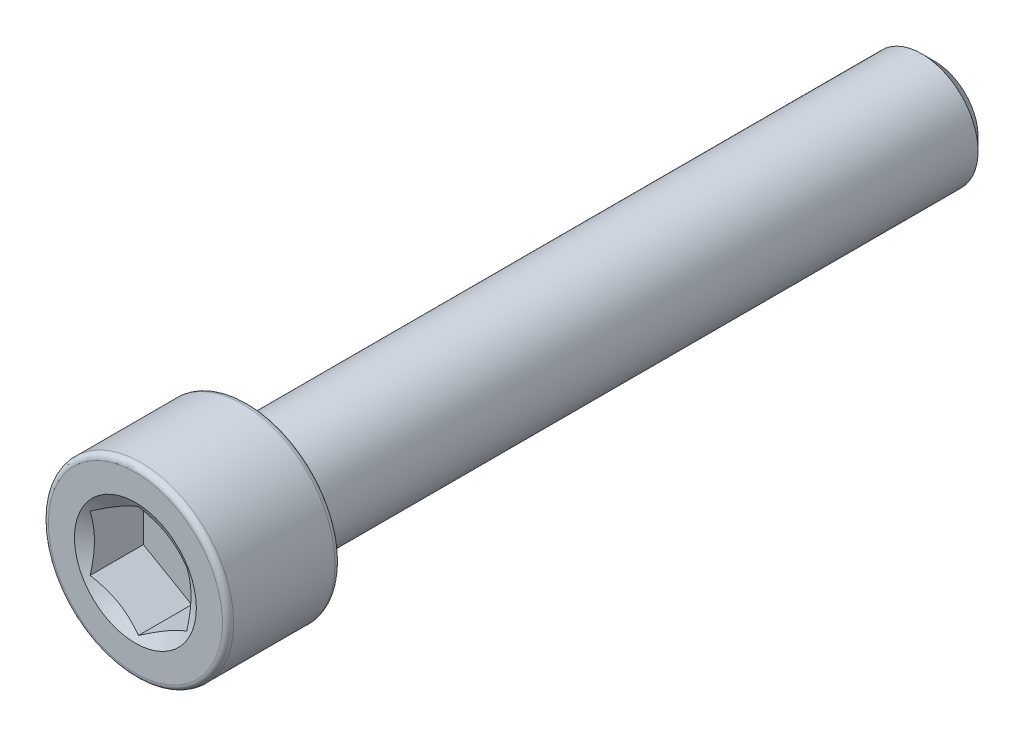
ISO-10303-21;
HEADER;
FILE_DESCRIPTION(('STEP AP214'),'2;1');
FILE_NAME('part.step','',(''),(''),'','','');
FILE_SCHEMA(('AUTOMOTIVE_DESIGN { 1 0 10303 214 1 1 1 1 }'));
ENDSEC;
DATA;
#1=APPLICATION_CONTEXT('core data for automotive mechanical design processes');
#2=APPLICATION_PROTOCOL_DEFINITION('international standard','automotive_design',2000,#1);
#3=PRODUCT_CONTEXT('',#1,'mechanical');
#4=PRODUCT('Part','Part','',(#3));
#5=PRODUCT_RELATED_PRODUCT_CATEGORY('part','',(#4));
#6=PRODUCT_DEFINITION_FORMATION('','',#4);
#7=PRODUCT_DEFINITION_CONTEXT('part definition',#1,'design');
#8=PRODUCT_DEFINITION('design','',#6,#7);
#9=PRODUCT_DEFINITION_SHAPE('','',#8);
#10=(LENGTH_UNIT() NAMED_UNIT(*) SI_UNIT(.MILLI.,.METRE.));
#11=(NAMED_UNIT(*) PLANE_ANGLE_UNIT() SI_UNIT($,.RADIAN.));
#12=(NAMED_UNIT(*) SI_UNIT($,.STERADIAN.) SOLID_ANGLE_UNIT());
#13=UNCERTAINTY_MEASURE_WITH_UNIT(LENGTH_MEASURE(1.E-05),#10,'distance_accuracy_value','');
#14=(GEOMETRIC_REPRESENTATION_CONTEXT(3) GLOBAL_UNCERTAINTY_ASSIGNED_CONTEXT((#13)) GLOBAL_UNIT_ASSIGNED_CONTEXT((#10,
#11,#12)) REPRESENTATION_CONTEXT('',''));
#15=CARTESIAN_POINT('',(0.,0.,0.));
#16=DIRECTION('',(0.,0.,1.));
#17=DIRECTION('',(1.,0.,0.));
#18=AXIS2_PLACEMENT_3D('',#15,#16,#17);
#19=CARTESIAN_POINT('',(0.,0.,-14.7828));
#20=DIRECTION('',(0.,0.,-1.));
#21=DIRECTION('',(-1.,0.,0.));
#22=AXIS2_PLACEMENT_3D('',#19,#20,#21);
#23=PLANE('',#22);
#24=CARTESIAN_POINT('',(0.,0.,-14.7828));
#25=DIRECTION('',(0.,0.,-1.));
#26=DIRECTION('',(-1.,0.,0.));
#27=AXIS2_PLACEMENT_3D('',#24,#25,#26);
#28=CIRCLE('',#27,1.60655000000001);
#29=CARTESIAN_POINT('',(-1.60655000000001,0.,-14.7828));
#30=VERTEX_POINT('',#29);
#31=EDGE_CURVE('E57',#30,#30,#28,.T.);
#32=ORIENTED_EDGE('',*,*,#31,.T.);
#33=EDGE_LOOP('',(#32));
#34=FACE_BOUND('',#33,.T.);
#35=ADVANCED_FACE('F43',(#34),#23,.T.);
#36=CARTESIAN_POINT('',(0.,0.,-14.7828));
#37=DIRECTION('',(0.,0.,1.));
#38=DIRECTION('',(1.,0.,0.));
#39=AXIS2_PLACEMENT_3D('',#36,#37,#38);
#40=CONICAL_SURFACE('',#39,1.60655000000001,0.78539816339745);
#41=CARTESIAN_POINT('',(0.,0.,-14.30655));
#42=DIRECTION('',(0.,0.,-1.));
#43=DIRECTION('',(-1.,0.,0.));
#44=AXIS2_PLACEMENT_3D('',#41,#42,#43);
#45=CIRCLE('',#44,2.08280000000001);
#46=CARTESIAN_POINT('',(-2.08280000000001,0.,-14.30655));
#47=VERTEX_POINT('',#46);
#48=EDGE_CURVE('E151',#47,#47,#45,.T.);
#49=ORIENTED_EDGE('',*,*,#48,.T.);
#50=EDGE_LOOP('',(#49));
#51=FACE_BOUND('',#50,.T.);
#52=ORIENTED_EDGE('',*,*,#31,.F.);
#53=EDGE_LOOP('',(#52));
#54=FACE_BOUND('',#53,.T.);
#55=ADVANCED_FACE('F159',(#51,#54),#40,.T.);
#56=CARTESIAN_POINT('',(0.,0.,-14.7828));
#57=DIRECTION('',(0.,0.,-1.));
#58=DIRECTION('',(-1.,0.,0.));
#59=AXIS2_PLACEMENT_3D('',#56,#57,#58);
#60=CYLINDRICAL_SURFACE('',#59,2.08280000000001);
#61=CARTESIAN_POINT('',(0.,0.,10.6172));
#62=DIRECTION('',(0.,0.,-1.));
#63=DIRECTION('',(-1.,0.,0.));
#64=AXIS2_PLACEMENT_3D('',#61,#62,#63);
#65=CIRCLE('',#64,2.08280000000001);
#66=CARTESIAN_POINT('',(-2.08280000000001,0.,10.6172));
#67=VERTEX_POINT('',#66);
#68=EDGE_CURVE('E147',#67,#67,#65,.T.);
#69=ORIENTED_EDGE('',*,*,#68,.T.);
#70=EDGE_LOOP('',(#69));
#71=FACE_BOUND('',#70,.T.);
#72=ORIENTED_EDGE('',*,*,#48,.F.);
#73=EDGE_LOOP('',(#72));
#74=FACE_BOUND('',#73,.T.);
#75=ADVANCED_FACE('F161',(#71,#74),#60,.T.);
#76=CARTESIAN_POINT('',(0.,2.0828,10.6172));
#77=DIRECTION('',(0.,0.,-1.));
#78=DIRECTION('',(-1.,0.,0.));
#79=AXIS2_PLACEMENT_3D('',#76,#77,#78);
#80=PLANE('',#79);
#81=CARTESIAN_POINT('',(0.,0.,10.6172));
#82=DIRECTION('',(0.,0.,-1.));
#83=DIRECTION('',(-1.,0.,0.));
#84=AXIS2_PLACEMENT_3D('',#81,#82,#83);
#85=CIRCLE('',#84,3.22072);
#86=CARTESIAN_POINT('',(-3.22072,0.,10.6172));
#87=VERTEX_POINT('',#86);
#88=EDGE_CURVE('E143',#87,#87,#85,.T.);
#89=ORIENTED_EDGE('',*,*,#88,.T.);
#90=EDGE_LOOP('',(#89));
#91=FACE_BOUND('',#90,.T.);
#92=ORIENTED_EDGE('',*,*,#68,.F.);
#93=EDGE_LOOP('',(#92));
#94=FACE_BOUND('',#93,.T.);
#95=ADVANCED_FACE('F168',(#91,#94),#80,.T.);
#96=CARTESIAN_POINT('',(0.,0.,10.82548));
#97=DIRECTION('',(0.,0.,-1.));
#98=DIRECTION('',(-1.,0.,0.));
#99=AXIS2_PLACEMENT_3D('',#96,#97,#98);
#100=TOROIDAL_SURFACE('',#99,3.22072,0.20828);
#101=CARTESIAN_POINT('',(0.,0.,10.82548));
#102=DIRECTION('',(0.,0.,-1.));
#103=DIRECTION('',(-1.,0.,0.));
#104=AXIS2_PLACEMENT_3D('',#101,#102,#103);
#105=CIRCLE('',#104,3.429);
#106=CARTESIAN_POINT('',(-3.429,0.,10.82548));
#107=VERTEX_POINT('',#106);
#108=EDGE_CURVE('E139',#107,#107,#105,.T.);
#109=ORIENTED_EDGE('',*,*,#108,.T.);
#110=EDGE_LOOP('',(#109));
#111=FACE_BOUND('',#110,.T.);
#112=ORIENTED_EDGE('',*,*,#88,.F.);
#113=EDGE_LOOP('',(#112));
#114=FACE_BOUND('',#113,.T.);
#115=ADVANCED_FACE('F174',(#111,#114),#100,.T.);
#116=CARTESIAN_POINT('',(0.,0.,-14.7828));
#117=DIRECTION('',(0.,0.,-1.));
#118=DIRECTION('',(-1.,0.,0.));
#119=AXIS2_PLACEMENT_3D('',#116,#117,#118);
#120=CYLINDRICAL_SURFACE('',#119,3.429);
#121=CARTESIAN_POINT('',(0.,0.,14.57452));
#122=DIRECTION('',(0.,0.,-1.));
#123=DIRECTION('',(-1.,0.,0.));
#124=AXIS2_PLACEMENT_3D('',#121,#122,#123);
#125=CIRCLE('',#124,3.429);
#126=CARTESIAN_POINT('',(-3.429,0.,14.57452));
#127=VERTEX_POINT('',#126);
#128=EDGE_CURVE('E135',#127,#127,#125,.T.);
#129=ORIENTED_EDGE('',*,*,#128,.T.);
#130=EDGE_LOOP('',(#129));
#131=FACE_BOUND('',#130,.T.);
#132=ORIENTED_EDGE('',*,*,#108,.F.);
#133=EDGE_LOOP('',(#132));
#134=FACE_BOUND('',#133,.T.);
#135=ADVANCED_FACE('F178',(#131,#134),#120,.T.);
#136=CARTESIAN_POINT('',(0.,0.,14.57452));
#137=DIRECTION('',(0.,0.,-1.));
#138=DIRECTION('',(-1.,0.,0.));
#139=AXIS2_PLACEMENT_3D('',#136,#137,#138);
#140=TOROIDAL_SURFACE('',#139,3.22072,0.208279999999999);
#141=CARTESIAN_POINT('',(0.,0.,14.7828));
#142=DIRECTION('',(0.,0.,-1.));
#143=DIRECTION('',(-1.,0.,0.));
#144=AXIS2_PLACEMENT_3D('',#141,#142,#143);
#145=CIRCLE('',#144,3.22072);
#146=CARTESIAN_POINT('',(-3.22072,0.,14.7828));
#147=VERTEX_POINT('',#146);
#148=EDGE_CURVE('E131',#147,#147,#145,.T.);
#149=ORIENTED_EDGE('',*,*,#148,.T.);
#150=EDGE_LOOP('',(#149));
#151=FACE_BOUND('',#150,.T.);
#152=ORIENTED_EDGE('',*,*,#128,.F.);
#153=EDGE_LOOP('',(#152));
#154=FACE_BOUND('',#153,.T.);
#155=ADVANCED_FACE('F182',(#151,#154),#140,.T.);
#156=CARTESIAN_POINT('',(0.,3.22072,14.7828));
#157=DIRECTION('',(0.,0.,1.));
#158=DIRECTION('',(1.,0.,0.));
#159=AXIS2_PLACEMENT_3D('',#156,#157,#158);
#160=PLANE('',#159);
#161=CARTESIAN_POINT('',(0.,0.,14.7828));
#162=DIRECTION('',(0.,0.,1.));
#163=DIRECTION('',(1.,0.,0.));
#164=AXIS2_PLACEMENT_3D('',#161,#162,#163);
#165=CIRCLE('',#164,2.25530582730141);
#166=CARTESIAN_POINT('',(2.25530582730141,0.,14.7828));
#167=VERTEX_POINT('',#166);
#168=EDGE_CURVE('E290',#167,#167,#165,.T.);
#169=ORIENTED_EDGE('',*,*,#168,.F.);
#170=EDGE_LOOP('',(#169));
#171=FACE_BOUND('',#170,.T.);
#172=ORIENTED_EDGE('',*,*,#148,.F.);
#173=EDGE_LOOP('',(#172));
#174=FACE_BOUND('',#173,.T.);
#175=ADVANCED_FACE('F186',(#171,#174),#160,.T.);
#176=CARTESIAN_POINT('',(0.,0.,14.7828));
#177=DIRECTION('',(0.,0.,1.));
#178=DIRECTION('',(1.,0.,0.));
#179=AXIS2_PLACEMENT_3D('',#176,#177,#178);
#180=CONICAL_SURFACE('',#179,2.25530582730141,1.0471975511966);
#181=ORIENTED_EDGE('',*,*,#168,.T.);
#182=EDGE_LOOP('',(#181));
#183=FACE_BOUND('',#182,.T.);
#184=CARTESIAN_POINT('',(1.7861375,1.03099602632701,14.6713902457683));
#185=CARTESIAN_POINT('',(1.70765298753214,1.07630908072754,14.6452168076921));
#186=CARTESIAN_POINT('',(1.62849100532972,1.12201327246169,14.6214125992998));
#187=CARTESIAN_POINT('',(1.46879612904912,1.2142131522705,14.5798611490479));
#188=CARTESIAN_POINT('',(1.38826039638754,1.26071047920205,14.5621286082323));
#189=CARTESIAN_POINT('',(1.22818707140352,1.35312885647165,14.5345240038494));
#190=CARTESIAN_POINT('',(1.14867411525882,1.39903568310585,14.524468239448));
#191=CARTESIAN_POINT('',(0.989273866724133,1.49106545950625,14.5124614604738));
#192=CARTESIAN_POINT('',(0.90938715411785,1.53718807453416,14.5105005056729));
#193=CARTESIAN_POINT('',(0.76010104079842,1.62337845224541,14.5145693606205));
#194=CARTESIAN_POINT('',(0.69067934773042,1.66345908542582,14.5196001252606));
#195=CARTESIAN_POINT('',(0.552288266102525,1.74335921365712,14.5355479939992));
#196=CARTESIAN_POINT('',(0.483319356586403,1.78317843213197,14.5464705514371));
#197=CARTESIAN_POINT('',(0.34464269577066,1.86324343958426,14.5737773973743));
#198=CARTESIAN_POINT('',(0.274952505639711,1.90347908961624,14.5902774949854));
#199=CARTESIAN_POINT('',(0.13661183024592,1.98335011579472,14.6277267258336));
#200=CARTESIAN_POINT('',(0.0679595711845167,2.0229865160443,14.6486670537832));
#201=CARTESIAN_POINT('',(-0.000200000000001202,2.06233846281553,14.6713902457683));
#202=B_SPLINE_CURVE_WITH_KNOTS('',3,(#184,#185,#186,#187,#188,#189,#190,#191,#192,#193,#194,
#195,#196,#197,#198,#199,#200,#201),.UNSPECIFIED.,.F.,.F.,(4,2,2,2,2,2,2,2,4),(0.,
0.283101204842065,0.566883100888333,0.84364073208294,1.12005841039329,1.3607861247116,
1.60173703564045,1.84803423693754,2.09384750668611),.UNSPECIFIED.);
#203=CARTESIAN_POINT('',(1.7859375,1.03111149638084,14.6713235735026));
#204=VERTEX_POINT('',#203);
#205=CARTESIAN_POINT('',(0.,2.06222299276169,14.6713235735026));
#206=VERTEX_POINT('',#205);
#207=EDGE_CURVE('E112',#204,#206,#202,.T.);
#208=ORIENTED_EDGE('',*,*,#207,.F.);
#209=CARTESIAN_POINT('',(1.7859375,-2.69758264771829,15.3485426868391));
#210=CARTESIAN_POINT('',(1.7859375,-2.6201225904152,15.3112636843077));
#211=CARTESIAN_POINT('',(1.7859375,-2.5424766848385,15.2743637946794));
#212=CARTESIAN_POINT('',(1.7859375,-2.38671397459031,15.2015371845213));
#213=CARTESIAN_POINT('',(1.7859375,-2.30859709065796,15.1656106337188));
#214=CARTESIAN_POINT('',(1.7859375,-2.15135521009003,15.0947492558914));
#215=CARTESIAN_POINT('',(1.7859375,-2.0722269823703,15.0598215722438));
#216=CARTESIAN_POINT('',(1.7859375,-1.91331493598689,14.9914965769099));
#217=CARTESIAN_POINT('',(1.7859375,-1.83353115094795,14.9580991873029));
#218=CARTESIAN_POINT('',(1.7859375,-1.67096618357135,14.8923456687277));
#219=CARTESIAN_POINT('',(1.7859375,-1.58816300038914,14.8600436191632));
#220=CARTESIAN_POINT('',(1.7859375,-1.42156112656087,14.7980632721621));
#221=CARTESIAN_POINT('',(1.7859375,-1.33776231333349,14.7683853016785));
#222=CARTESIAN_POINT('',(1.7859375,-1.1692220220391,14.7124867539738));
#223=CARTESIAN_POINT('',(1.7859375,-1.084483165363,14.6862583568392));
#224=CARTESIAN_POINT('',(1.7859375,-0.913786163547338,14.6381433270575));
#225=CARTESIAN_POINT('',(1.7859375,-0.827828324781464,14.6162556234588));
#226=CARTESIAN_POINT('',(1.7859375,-0.65508454988443,14.5780261588678));
#227=CARTESIAN_POINT('',(1.7859375,-0.568304335338395,14.5616590421217));
#228=CARTESIAN_POINT('',(1.7859375,-0.393746048068967,14.5354528135952));
#229=CARTESIAN_POINT('',(1.7859375,-0.305968052538009,14.5256132002697));
#230=CARTESIAN_POINT('',(1.7859375,-0.130962716485577,14.5133785557359));
#231=CARTESIAN_POINT('',(1.7859375,-0.0437418469765716,14.5108936055758));
#232=CARTESIAN_POINT('',(1.7859375,0.130592934900125,14.513336070232));
#233=CARTESIAN_POINT('',(1.7859375,0.21770684100056,14.518263900411));
#234=CARTESIAN_POINT('',(1.7859375,0.431120733446831,14.5389821974728));
#235=CARTESIAN_POINT('',(1.7859375,0.557038517233457,14.5587228004352));
#236=CARTESIAN_POINT('',(1.7859375,0.806440222774732,14.6100381632509));
#237=CARTESIAN_POINT('',(1.7859375,0.929921492877505,14.6416251403236));
#238=CARTESIAN_POINT('',(1.7859375,1.17712757795221,14.7140666470735));
#239=CARTESIAN_POINT('',(1.7859375,1.30079401125151,14.7551156843391));
#240=CARTESIAN_POINT('',(1.7859375,1.48458504652945,14.8212570287602));
#241=CARTESIAN_POINT('',(1.7859375,1.54555601200979,14.8440621265715));
#242=CARTESIAN_POINT('',(1.7859375,1.66700448583618,14.8909509496154));
#243=CARTESIAN_POINT('',(1.7859375,1.72748200297302,14.9150346520121));
#244=CARTESIAN_POINT('',(1.7859375,1.88424149051046,14.9790616553898));
#245=CARTESIAN_POINT('',(1.7859375,1.98018443802618,15.0198329191166));
#246=CARTESIAN_POINT('',(1.7859375,2.17117609670512,15.1034247196407));
#247=CARTESIAN_POINT('',(1.7859375,2.26622473668082,15.1462454179505));
#248=CARTESIAN_POINT('',(1.7859375,2.55034675834729,15.2770525004115));
#249=CARTESIAN_POINT('',(1.7859375,2.73834755541705,15.3673633596409));
#250=CARTESIAN_POINT('',(1.7859375,3.11271398702262,15.5518619991649));
#251=CARTESIAN_POINT('',(1.7859375,3.29907721105926,15.6460546102587));
#252=CARTESIAN_POINT('',(1.7859375,3.67050227471046,15.8368957072539));
#253=CARTESIAN_POINT('',(1.7859375,3.85556431392614,15.9335438055063));
#254=CARTESIAN_POINT('',(1.7859375,4.20682233829504,16.11903234663));
#255=CARTESIAN_POINT('',(1.7859375,4.37310096820637,16.207716846137));
#256=CARTESIAN_POINT('',(1.7859375,4.70512305489091,16.3860996279772));
#257=CARTESIAN_POINT('',(1.7859375,4.87086648642208,16.4757979572539));
#258=CARTESIAN_POINT('',(1.7859375,5.20149434658741,16.6557084214208));
#259=CARTESIAN_POINT('',(1.7859375,5.36637988633188,16.7459185171521));
#260=CARTESIAN_POINT('',(1.7859375,5.69581647813698,16.9269235664943));
#261=CARTESIAN_POINT('',(1.7859375,5.86036755026335,17.0177184835707));
#262=CARTESIAN_POINT('',(1.7859375,6.02479942172329,17.1087274610164));
#263=B_SPLINE_CURVE_WITH_KNOTS('',3,(#209,#210,#211,#212,#213,#214,#215,#216,#217,#218,#219,
#220,#221,#222,#223,#224,#225,#226,#227,#228,#229,#230,#231,#232,#233,#234,#235,#236,#237,#238,
#239,#240,#241,#242,#243,#244,#245,#246,#247,#248,#249,#250,#251,#252,#253,#254,#255,#256,#257,
#258,#259,#260,#261,#262),.UNSPECIFIED.,.F.,.F.,(4,2,2,2,2,2,2,2,2,2,2,2,2,2,2,2,2,2,2,2,2,2,2,
2,2,2,4),(0.,0.257895100869512,0.515834886822403,0.775304092310056,1.03476007121658,
1.30136802092372,1.56800914256978,1.83403498977159,2.09999512023697,2.36471652541159,
2.62941758818124,2.89086873629834,3.15233453493419,3.53391158235073,3.91588323889408,
4.30654567753013,4.50182529543226,4.69710142679918,5.00980707595598,5.3225374096282,
5.94815647890532,6.57457913899203,7.20090351250652,7.76625052018439,8.33162381337451,
8.89547174137729,9.45928478023968),.UNSPECIFIED.);
#264=CARTESIAN_POINT('',(1.7859375,-1.03111149638084,14.6713235735026));
#265=VERTEX_POINT('',#264);
#266=EDGE_CURVE('E232',#265,#204,#263,.T.);
#267=ORIENTED_EDGE('',*,*,#266,.F.);
#268=CARTESIAN_POINT('',(-0.000200000000001353,-2.06233846281553,14.6713902457683));
#269=CARTESIAN_POINT('',(0.078284512467857,-2.01702540841499,14.6452168076921));
#270=CARTESIAN_POINT('',(0.157446494670274,-1.97132121668084,14.6214125992998));
#271=CARTESIAN_POINT('',(0.317141370950877,-1.87912133687203,14.5798611490479));
#272=CARTESIAN_POINT('',(0.397677103612454,-1.83262400994049,14.5621286082323));
#273=CARTESIAN_POINT('',(0.557750428596472,-1.74020563267089,14.5345240038494));
#274=CARTESIAN_POINT('',(0.63726338474117,-1.69429880603668,14.524468239448));
#275=CARTESIAN_POINT('',(0.796663633275862,-1.60226902963629,14.5124614604738));
#276=CARTESIAN_POINT('',(0.876550345882144,-1.55614641460837,14.5105005056729));
#277=CARTESIAN_POINT('',(1.02583645920157,-1.46995603689713,14.5145693606205));
#278=CARTESIAN_POINT('',(1.09525815226957,-1.42987540371672,14.5196001252606));
#279=CARTESIAN_POINT('',(1.23364923389747,-1.34997527548541,14.5355479939992));
#280=CARTESIAN_POINT('',(1.30261814341359,-1.31015605701056,14.5464705514371));
#281=CARTESIAN_POINT('',(1.44129480422933,-1.23009104955827,14.5737773973743));
#282=CARTESIAN_POINT('',(1.51098499436028,-1.1898553995263,14.5902774949854));
#283=CARTESIAN_POINT('',(1.64932566975407,-1.10998437334781,14.6277267258336));
#284=CARTESIAN_POINT('',(1.71797792881548,-1.07034797309824,14.6486670537832));
#285=CARTESIAN_POINT('',(1.7861375,-1.03099602632701,14.6713902457683));
#286=B_SPLINE_CURVE_WITH_KNOTS('',3,(#268,#269,#270,#271,#272,#273,#274,#275,#276,#277,#278,
#279,#280,#281,#282,#283,#284,#285),.UNSPECIFIED.,.F.,.F.,(4,2,2,2,2,2,2,2,4),(0.,
0.283101204842065,0.566883100888333,0.84364073208294,1.12005841039329,1.3607861247116,
1.60173703564045,1.84803423693754,2.09384750668611),.UNSPECIFIED.);
#287=CARTESIAN_POINT('',(0.,-2.06222299276169,14.6713235735026));
#288=VERTEX_POINT('',#287);
#289=EDGE_CURVE('E226',#288,#265,#286,.T.);
#290=ORIENTED_EDGE('',*,*,#289,.F.);
#291=CARTESIAN_POINT('',(-1.7861375,-1.03099602632701,14.6713902457683));
#292=CARTESIAN_POINT('',(-1.70765298753214,-1.07630908072754,14.6452168076921));
#293=CARTESIAN_POINT('',(-1.62849100532972,-1.12201327246169,14.6214125992998));
#294=CARTESIAN_POINT('',(-1.46879612904912,-1.2142131522705,14.5798611490479));
#295=CARTESIAN_POINT('',(-1.38826039638754,-1.26071047920205,14.5621286082323));
#296=CARTESIAN_POINT('',(-1.22818707140352,-1.35312885647165,14.5345240038494));
#297=CARTESIAN_POINT('',(-1.14867411525882,-1.39903568310585,14.524468239448));
#298=CARTESIAN_POINT('',(-0.989273866724133,-1.49106545950625,14.5124614604738));
#299=CARTESIAN_POINT('',(-0.90938715411785,-1.53718807453416,14.5105005056729));
#300=CARTESIAN_POINT('',(-0.760101040798421,-1.62337845224541,14.5145693606205));
#301=CARTESIAN_POINT('',(-0.69067934773042,-1.66345908542582,14.5196001252606));
#302=CARTESIAN_POINT('',(-0.552288266102526,-1.74335921365713,14.5355479939992));
#303=CARTESIAN_POINT('',(-0.483319356586404,-1.78317843213197,14.5464705514371));
#304=CARTESIAN_POINT('',(-0.344642695770662,-1.86324343958426,14.5737773973743));
#305=CARTESIAN_POINT('',(-0.274952505639713,-1.90347908961624,14.5902774949854));
#306=CARTESIAN_POINT('',(-0.136611830245922,-1.98335011579472,14.6277267258336));
#307=CARTESIAN_POINT('',(-0.0679595711845196,-2.0229865160443,14.6486670537832));
#308=CARTESIAN_POINT('',(0.000199999999998539,-2.06233846281553,14.6713902457683));
#309=B_SPLINE_CURVE_WITH_KNOTS('',3,(#291,#292,#293,#294,#295,#296,#297,#298,#299,#300,#301,
#302,#303,#304,#305,#306,#307,#308),.UNSPECIFIED.,.F.,.F.,(4,2,2,2,2,2,2,2,4),(0.,
0.283101204842066,0.566883100888334,0.84364073208294,1.12005841039329,1.3607861247116,
1.60173703564045,1.84803423693754,2.0938475066861),.UNSPECIFIED.);
#310=CARTESIAN_POINT('',(-1.7859375,-1.03111149638085,14.6713235735026));
#311=VERTEX_POINT('',#310);
#312=EDGE_CURVE('E64',#311,#288,#309,.T.);
#313=ORIENTED_EDGE('',*,*,#312,.F.);
#314=CARTESIAN_POINT('',(-1.7859375,-2.6975826477183,15.3485426868391));
#315=CARTESIAN_POINT('',(-1.7859375,-2.6201225904152,15.3112636843077));
#316=CARTESIAN_POINT('',(-1.7859375,-2.5424766848385,15.2743637946794));
#317=CARTESIAN_POINT('',(-1.7859375,-2.38671397459032,15.2015371845213));
#318=CARTESIAN_POINT('',(-1.7859375,-2.30859709065796,15.1656106337188));
#319=CARTESIAN_POINT('',(-1.7859375,-2.15135521009004,15.0947492558914));
#320=CARTESIAN_POINT('',(-1.7859375,-2.0722269823703,15.0598215722438));
#321=CARTESIAN_POINT('',(-1.7859375,-1.9133149359869,14.9914965769099));
#322=CARTESIAN_POINT('',(-1.7859375,-1.83353115094795,14.9580991873029));
#323=CARTESIAN_POINT('',(-1.7859375,-1.67096618357136,14.8923456687277));
#324=CARTESIAN_POINT('',(-1.7859375,-1.58816300038914,14.8600436191632));
#325=CARTESIAN_POINT('',(-1.7859375,-1.42156112656088,14.7980632721621));
#326=CARTESIAN_POINT('',(-1.7859375,-1.33776231333349,14.7683853016785));
#327=CARTESIAN_POINT('',(-1.7859375,-1.16922202203911,14.7124867539738));
#328=CARTESIAN_POINT('',(-1.7859375,-1.084483165363,14.6862583568392));
#329=CARTESIAN_POINT('',(-1.7859375,-0.913786163547341,14.6381433270575));
#330=CARTESIAN_POINT('',(-1.7859375,-0.827828324781467,14.6162556234588));
#331=CARTESIAN_POINT('',(-1.7859375,-0.655084549884432,14.5780261588678));
#332=CARTESIAN_POINT('',(-1.7859375,-0.568304335338397,14.5616590421217));
#333=CARTESIAN_POINT('',(-1.7859375,-0.393746048068968,14.5354528135952));
#334=CARTESIAN_POINT('',(-1.7859375,-0.30596805253801,14.5256132002697));
#335=CARTESIAN_POINT('',(-1.7859375,-0.130962716485578,14.5133785557359));
#336=CARTESIAN_POINT('',(-1.7859375,-0.0437418469765717,14.5108936055758));
#337=CARTESIAN_POINT('',(-1.7859375,0.130592934900126,14.513336070232));
#338=CARTESIAN_POINT('',(-1.7859375,0.217706841000561,14.518263900411));
#339=CARTESIAN_POINT('',(-1.7859375,0.431120733446832,14.5389821974728));
#340=CARTESIAN_POINT('',(-1.7859375,0.557038517233458,14.5587228004352));
#341=CARTESIAN_POINT('',(-1.7859375,0.806440222774732,14.6100381632509));
#342=CARTESIAN_POINT('',(-1.7859375,0.929921492877505,14.6416251403236));
#343=CARTESIAN_POINT('',(-1.7859375,1.17712757795221,14.7140666470735));
#344=CARTESIAN_POINT('',(-1.7859375,1.30079401125151,14.7551156843391));
#345=CARTESIAN_POINT('',(-1.7859375,1.48458504652945,14.8212570287602));
#346=CARTESIAN_POINT('',(-1.7859375,1.54555601200979,14.8440621265715));
#347=CARTESIAN_POINT('',(-1.7859375,1.66700448583619,14.8909509496154));
#348=CARTESIAN_POINT('',(-1.7859375,1.72748200297302,14.9150346520121));
#349=CARTESIAN_POINT('',(-1.7859375,1.88424149051046,14.9790616553898));
#350=CARTESIAN_POINT('',(-1.7859375,1.98018443802618,15.0198329191166));
#351=CARTESIAN_POINT('',(-1.7859375,2.17117609670513,15.1034247196407));
#352=CARTESIAN_POINT('',(-1.7859375,2.26622473668082,15.1462454179505));
#353=CARTESIAN_POINT('',(-1.7859375,2.5503467583473,15.2770525004115));
#354=CARTESIAN_POINT('',(-1.7859375,2.73834755541705,15.3673633596409));
#355=CARTESIAN_POINT('',(-1.7859375,3.11271398702263,15.5518619991649));
#356=CARTESIAN_POINT('',(-1.78593749999999,3.29907721105926,15.6460546102587));
#357=CARTESIAN_POINT('',(-1.78593749999999,3.67050227471047,15.8368957072539));
#358=CARTESIAN_POINT('',(-1.78593749999999,3.85556431392615,15.9335438055063));
#359=CARTESIAN_POINT('',(-1.78593749999999,4.20682233829505,16.11903234663));
#360=CARTESIAN_POINT('',(-1.78593749999999,4.37310096820638,16.207716846137));
#361=CARTESIAN_POINT('',(-1.78593749999999,4.70512305489092,16.3860996279772));
#362=CARTESIAN_POINT('',(-1.78593749999999,4.87086648642209,16.4757979572539));
#363=CARTESIAN_POINT('',(-1.78593749999999,5.20149434658741,16.6557084214208));
#364=CARTESIAN_POINT('',(-1.78593749999999,5.36637988633189,16.7459185171521));
#365=CARTESIAN_POINT('',(-1.78593749999999,5.69581647813698,16.9269235664943));
#366=CARTESIAN_POINT('',(-1.78593749999999,5.86036755026335,17.0177184835707));
#367=CARTESIAN_POINT('',(-1.78593749999999,6.02479942172329,17.1087274610164));
#368=B_SPLINE_CURVE_WITH_KNOTS('',3,(#314,#315,#316,#317,#318,#319,#320,#321,#322,#323,#324,
#325,#326,#327,#328,#329,#330,#331,#332,#333,#334,#335,#336,#337,#338,#339,#340,#341,#342,#343,
#344,#345,#346,#347,#348,#349,#350,#351,#352,#353,#354,#355,#356,#357,#358,#359,#360,#361,#362,
#363,#364,#365,#366,#367),.UNSPECIFIED.,.F.,.F.,(4,2,2,2,2,2,2,2,2,2,2,2,2,2,2,2,2,2,2,2,2,2,2,
2,2,2,4),(0.,0.257895100869512,0.515834886822404,0.775304092310056,1.03476007121658,
1.30136802092372,1.56800914256978,1.83403498977159,2.09999512023697,2.3647165254116,
2.62941758818124,2.89086873629834,3.1523345349342,3.53391158235073,3.91588323889409,
4.30654567753014,4.50182529543227,4.69710142679919,5.00980707595599,5.32253740962821,
5.94815647890533,6.57457913899205,7.20090351250654,7.76625052018441,8.33162381337453,
8.89547174137731,9.4592847802397),.UNSPECIFIED.);
#369=CARTESIAN_POINT('',(-1.7859375,1.03111149638085,14.6713235735026));
#370=VERTEX_POINT('',#369);
#371=EDGE_CURVE('E11',#370,#311,#368,.F.);
#372=ORIENTED_EDGE('',*,*,#371,.F.);
#373=CARTESIAN_POINT('',(0.000199999999998808,2.06233846281553,14.6713902457683));
#374=CARTESIAN_POINT('',(-0.0782845124678592,2.01702540841499,14.6452168076921));
#375=CARTESIAN_POINT('',(-0.157446494670277,1.97132121668084,14.6214125992998));
#376=CARTESIAN_POINT('',(-0.317141370950879,1.87912133687203,14.5798611490479));
#377=CARTESIAN_POINT('',(-0.397677103612457,1.83262400994049,14.5621286082323));
#378=CARTESIAN_POINT('',(-0.557750428596474,1.74020563267089,14.5345240038494));
#379=CARTESIAN_POINT('',(-0.637263384741173,1.69429880603668,14.524468239448));
#380=CARTESIAN_POINT('',(-0.796663633275864,1.60226902963628,14.5124614604738));
#381=CARTESIAN_POINT('',(-0.876550345882147,1.55614641460837,14.5105005056729));
#382=CARTESIAN_POINT('',(-1.02583645920158,1.46995603689713,14.5145693606205));
#383=CARTESIAN_POINT('',(-1.09525815226958,1.42987540371672,14.5196001252606));
#384=CARTESIAN_POINT('',(-1.23364923389747,1.34997527548541,14.5355479939992));
#385=CARTESIAN_POINT('',(-1.30261814341359,1.31015605701056,14.5464705514371));
#386=CARTESIAN_POINT('',(-1.44129480422934,1.23009104955827,14.5737773973743));
#387=CARTESIAN_POINT('',(-1.51098499436028,1.18985539952629,14.5902774949854));
#388=CARTESIAN_POINT('',(-1.64932566975408,1.10998437334782,14.6277267258336));
#389=CARTESIAN_POINT('',(-1.71797792881548,1.07034797309824,14.6486670537832));
#390=CARTESIAN_POINT('',(-1.7861375,1.03099602632701,14.6713902457683));
#391=B_SPLINE_CURVE_WITH_KNOTS('',3,(#373,#374,#375,#376,#377,#378,#379,#380,#381,#382,#383,
#384,#385,#386,#387,#388,#389,#390),.UNSPECIFIED.,.F.,.F.,(4,2,2,2,2,2,2,2,4),(0.,
0.283101204842065,0.566883100888333,0.84364073208294,1.12005841039329,1.3607861247116,
1.60173703564045,1.84803423693754,2.0938475066861),.UNSPECIFIED.);
#392=EDGE_CURVE('E102',#206,#370,#391,.T.);
#393=ORIENTED_EDGE('',*,*,#392,.F.);
#394=EDGE_LOOP('',(#208,#267,#290,#313,#372,#393));
#395=FACE_BOUND('',#394,.T.);
#396=ADVANCED_FACE('F101',(#183,#395),#180,.F.);
#397=CARTESIAN_POINT('',(0.,0.,12.7));
#398=DIRECTION('',(0.,0.,1.));
#399=DIRECTION('',(1.,0.,0.));
#400=AXIS2_PLACEMENT_3D('',#397,#398,#399);
#401=PLANE('',#400);
#402=DIRECTION('',(-0.866025403784438,-0.5,0.));
#403=VECTOR('',#402,1.);
#404=CARTESIAN_POINT('',(0.,2.06222299276169,12.7));
#405=LINE('',#404,#403);
#406=CARTESIAN_POINT('',(0.,2.06222299276169,12.7));
#407=VERTEX_POINT('',#406);
#408=CARTESIAN_POINT('',(-1.7859375,1.03111149638085,12.7));
#409=VERTEX_POINT('',#408);
#410=EDGE_CURVE('E111',#407,#409,#405,.T.);
#411=ORIENTED_EDGE('',*,*,#410,.T.);
#412=DIRECTION('',(0.,-1.,0.));
#413=VECTOR('',#412,1.);
#414=CARTESIAN_POINT('',(-1.7859375,1.03111149638085,12.7));
#415=LINE('',#414,#413);
#416=CARTESIAN_POINT('',(-1.7859375,-1.03111149638085,12.7));
#417=VERTEX_POINT('',#416);
#418=EDGE_CURVE('E116',#409,#417,#415,.T.);
#419=ORIENTED_EDGE('',*,*,#418,.T.);
#420=DIRECTION('',(0.866025403784439,-0.5,0.));
#421=VECTOR('',#420,1.);
#422=CARTESIAN_POINT('',(-1.7859375,-1.03111149638085,12.7));
#423=LINE('',#422,#421);
#424=CARTESIAN_POINT('',(0.,-2.06222299276169,12.7));
#425=VERTEX_POINT('',#424);
#426=EDGE_CURVE('E259',#417,#425,#423,.T.);
#427=ORIENTED_EDGE('',*,*,#426,.T.);
#428=DIRECTION('',(0.866025403784438,0.5,0.));
#429=VECTOR('',#428,1.);
#430=CARTESIAN_POINT('',(0.,-2.06222299276169,12.7));
#431=LINE('',#430,#429);
#432=CARTESIAN_POINT('',(1.7859375,-1.03111149638084,12.7));
#433=VERTEX_POINT('',#432);
#434=EDGE_CURVE('E264',#425,#433,#431,.T.);
#435=ORIENTED_EDGE('',*,*,#434,.T.);
#436=DIRECTION('',(0.,1.,0.));
#437=VECTOR('',#436,1.);
#438=CARTESIAN_POINT('',(1.7859375,-1.03111149638084,12.7));
#439=LINE('',#438,#437);
#440=CARTESIAN_POINT('',(1.7859375,1.03111149638084,12.7));
#441=VERTEX_POINT('',#440);
#442=EDGE_CURVE('E127',#433,#441,#439,.T.);
#443=ORIENTED_EDGE('',*,*,#442,.T.);
#444=DIRECTION('',(-0.866025403784439,0.5,0.));
#445=VECTOR('',#444,1.);
#446=CARTESIAN_POINT('',(1.7859375,1.03111149638084,12.7));
#447=LINE('',#446,#445);
#448=EDGE_CURVE('E120',#441,#407,#447,.T.);
#449=ORIENTED_EDGE('',*,*,#448,.T.);
#450=EDGE_LOOP('',(#411,#419,#427,#435,#443,#449));
#451=FACE_BOUND('',#450,.T.);
#452=ADVANCED_FACE('F212',(#451),#401,.T.);
#453=CARTESIAN_POINT('',(-1.7859375,1.03111149638085,12.7));
#454=DIRECTION('',(-1.,0.,0.));
#455=DIRECTION('',(0.,-1.,0.));
#456=AXIS2_PLACEMENT_3D('',#453,#454,#455);
#457=PLANE('',#456);
#458=DIRECTION('',(0.,0.,1.));
#459=VECTOR('',#458,1.);
#460=CARTESIAN_POINT('',(-1.7859375,1.03111149638085,12.7));
#461=LINE('',#460,#459);
#462=EDGE_CURVE('E108',#409,#370,#461,.T.);
#463=ORIENTED_EDGE('',*,*,#462,.T.);
#464=ORIENTED_EDGE('',*,*,#371,.T.);
#465=DIRECTION('',(0.,0.,1.));
#466=VECTOR('',#465,1.);
#467=CARTESIAN_POINT('',(-1.7859375,-1.03111149638085,12.7));
#468=LINE('',#467,#466);
#469=EDGE_CURVE('E119',#417,#311,#468,.T.);
#470=ORIENTED_EDGE('',*,*,#469,.F.);
#471=ORIENTED_EDGE('',*,*,#418,.F.);
#472=EDGE_LOOP('',(#463,#464,#470,#471));
#473=FACE_BOUND('',#472,.T.);
#474=ADVANCED_FACE('F114',(#473),#457,.F.);
#475=CARTESIAN_POINT('',(-1.7859375,-1.03111149638085,12.7));
#476=DIRECTION('',(-0.5,-0.866025403784439,0.));
#477=DIRECTION('',(0.866025403784439,-0.5,0.));
#478=AXIS2_PLACEMENT_3D('',#475,#476,#477);
#479=PLANE('',#478);
#480=ORIENTED_EDGE('',*,*,#469,.T.);
#481=ORIENTED_EDGE('',*,*,#312,.T.);
#482=DIRECTION('',(0.,0.,1.));
#483=VECTOR('',#482,1.);
#484=CARTESIAN_POINT('',(0.,-2.06222299276169,12.7));
#485=LINE('',#484,#483);
#486=EDGE_CURVE('E124',#425,#288,#485,.T.);
#487=ORIENTED_EDGE('',*,*,#486,.F.);
#488=ORIENTED_EDGE('',*,*,#426,.F.);
#489=EDGE_LOOP('',(#480,#481,#487,#488));
#490=FACE_BOUND('',#489,.T.);
#491=ADVANCED_FACE('F248',(#490),#479,.F.);
#492=CARTESIAN_POINT('',(0.,-2.06222299276169,12.7));
#493=DIRECTION('',(0.5,-0.866025403784438,0.));
#494=DIRECTION('',(0.866025403784438,0.5,0.));
#495=AXIS2_PLACEMENT_3D('',#492,#493,#494);
#496=PLANE('',#495);
#497=ORIENTED_EDGE('',*,*,#486,.T.);
#498=ORIENTED_EDGE('',*,*,#289,.T.);
#499=DIRECTION('',(0.,0.,1.));
#500=VECTOR('',#499,1.);
#501=CARTESIAN_POINT('',(1.7859375,-1.03111149638084,12.7));
#502=LINE('',#501,#500);
#503=EDGE_CURVE('E280',#433,#265,#502,.T.);
#504=ORIENTED_EDGE('',*,*,#503,.F.);
#505=ORIENTED_EDGE('',*,*,#434,.F.);
#506=EDGE_LOOP('',(#497,#498,#504,#505));
#507=FACE_BOUND('',#506,.T.);
#508=ADVANCED_FACE('F243',(#507),#496,.F.);
#509=CARTESIAN_POINT('',(1.7859375,-1.03111149638084,12.7));
#510=DIRECTION('',(1.,0.,0.));
#511=DIRECTION('',(0.,0.,-1.));
#512=AXIS2_PLACEMENT_3D('',#509,#510,#511);
#513=PLANE('',#512);
#514=ORIENTED_EDGE('',*,*,#503,.T.);
#515=ORIENTED_EDGE('',*,*,#266,.T.);
#516=DIRECTION('',(0.,0.,1.));
#517=VECTOR('',#516,1.);
#518=CARTESIAN_POINT('',(1.7859375,1.03111149638084,12.7));
#519=LINE('',#518,#517);
#520=EDGE_CURVE('E276',#441,#204,#519,.T.);
#521=ORIENTED_EDGE('',*,*,#520,.F.);
#522=ORIENTED_EDGE('',*,*,#442,.F.);
#523=EDGE_LOOP('',(#514,#515,#521,#522));
#524=FACE_BOUND('',#523,.T.);
#525=ADVANCED_FACE('F240',(#524),#513,.F.);
#526=CARTESIAN_POINT('',(1.7859375,1.03111149638084,12.7));
#527=DIRECTION('',(0.5,0.866025403784439,0.));
#528=DIRECTION('',(-0.866025403784439,0.5,0.));
#529=AXIS2_PLACEMENT_3D('',#526,#527,#528);
#530=PLANE('',#529);
#531=ORIENTED_EDGE('',*,*,#520,.T.);
#532=ORIENTED_EDGE('',*,*,#207,.T.);
#533=DIRECTION('',(0.,0.,1.));
#534=VECTOR('',#533,1.);
#535=CARTESIAN_POINT('',(0.,2.06222299276169,12.7));
#536=LINE('',#535,#534);
#537=EDGE_CURVE('E71',#407,#206,#536,.T.);
#538=ORIENTED_EDGE('',*,*,#537,.F.);
#539=ORIENTED_EDGE('',*,*,#448,.F.);
#540=EDGE_LOOP('',(#531,#532,#538,#539));
#541=FACE_BOUND('',#540,.T.);
#542=ADVANCED_FACE('F193',(#541),#530,.F.);
#543=CARTESIAN_POINT('',(0.,2.06222299276169,12.7));
#544=DIRECTION('',(-0.5,0.866025403784438,0.));
#545=DIRECTION('',(-0.866025403784439,-0.5,0.));
#546=AXIS2_PLACEMENT_3D('',#543,#544,#545);
#547=PLANE('',#546);
#548=ORIENTED_EDGE('',*,*,#537,.T.);
#549=ORIENTED_EDGE('',*,*,#392,.T.);
#550=ORIENTED_EDGE('',*,*,#462,.F.);
#551=ORIENTED_EDGE('',*,*,#410,.F.);
#552=EDGE_LOOP('',(#548,#549,#550,#551));
#553=FACE_BOUND('',#552,.T.);
#554=ADVANCED_FACE('F107',(#553),#547,.F.);
#555=CLOSED_SHELL('',(#35,#55,#75,#95,#115,#135,#155,#175,#396,#452,#474,#491,#508,#525,#542,#554));
#556=MANIFOLD_SOLID_BREP('B2',#555);
#557=ADVANCED_BREP_SHAPE_REPRESENTATION('',(#18,#556),#14);
#558=SHAPE_DEFINITION_REPRESENTATION(#9,#557);
ENDSEC;
END-ISO-10303-21;
